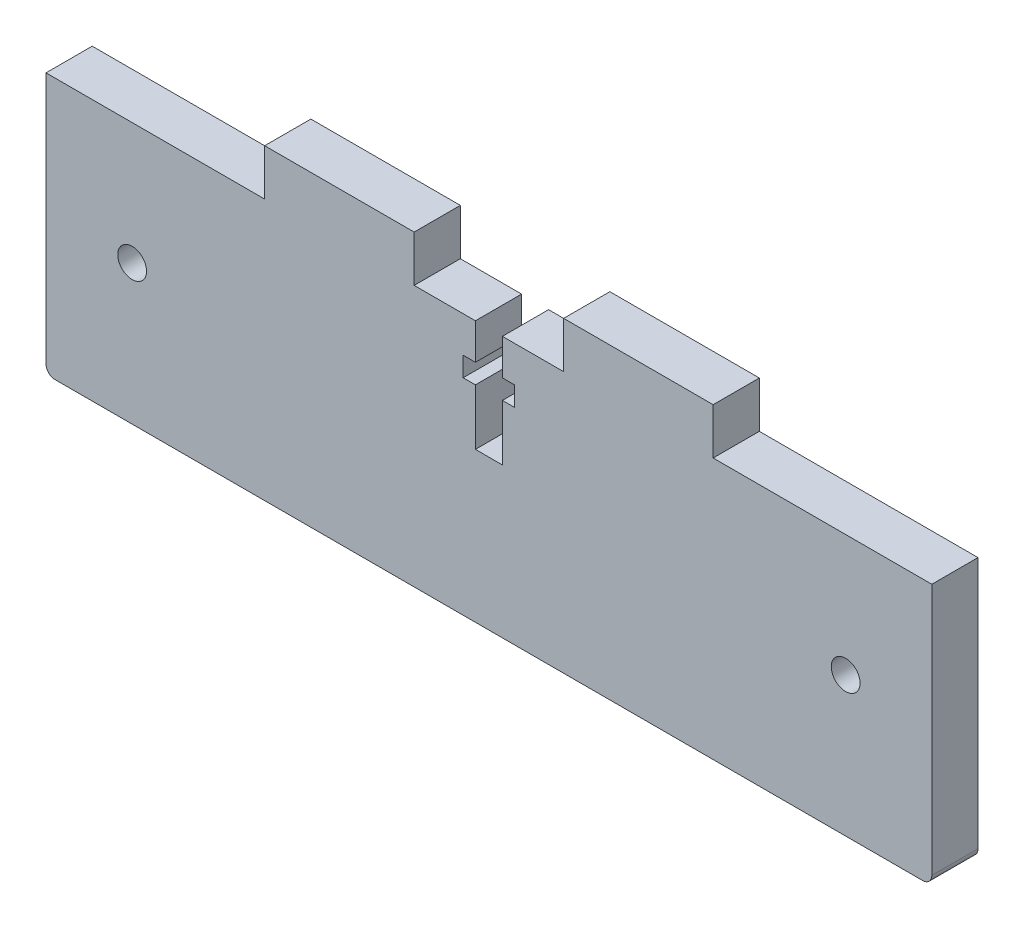
ISO-10303-21;
HEADER;
FILE_DESCRIPTION(('STEP AP214'),'2;1');
FILE_NAME('part.step','',(''),(''),'','','');
FILE_SCHEMA(('AUTOMOTIVE_DESIGN { 1 0 10303 214 1 1 1 1 }'));
ENDSEC;
DATA;
#1=APPLICATION_CONTEXT('core data for automotive mechanical design processes');
#2=APPLICATION_PROTOCOL_DEFINITION('international standard','automotive_design',2000,#1);
#3=PRODUCT_CONTEXT('',#1,'mechanical');
#4=PRODUCT('Part','Part','',(#3));
#5=PRODUCT_RELATED_PRODUCT_CATEGORY('part','',(#4));
#6=PRODUCT_DEFINITION_FORMATION('','',#4);
#7=PRODUCT_DEFINITION_CONTEXT('part definition',#1,'design');
#8=PRODUCT_DEFINITION('design','',#6,#7);
#9=PRODUCT_DEFINITION_SHAPE('','',#8);
#10=(LENGTH_UNIT() NAMED_UNIT(*) SI_UNIT(.MILLI.,.METRE.));
#11=(NAMED_UNIT(*) PLANE_ANGLE_UNIT() SI_UNIT($,.RADIAN.));
#12=(NAMED_UNIT(*) SI_UNIT($,.STERADIAN.) SOLID_ANGLE_UNIT());
#13=UNCERTAINTY_MEASURE_WITH_UNIT(LENGTH_MEASURE(1.E-05),#10,'distance_accuracy_value','');
#14=(GEOMETRIC_REPRESENTATION_CONTEXT(3) GLOBAL_UNCERTAINTY_ASSIGNED_CONTEXT((#13)) GLOBAL_UNIT_ASSIGNED_CONTEXT((#10,
#11,#12)) REPRESENTATION_CONTEXT('',''));
#15=CARTESIAN_POINT('',(0.,0.,0.));
#16=DIRECTION('',(0.,0.,1.));
#17=DIRECTION('',(1.,0.,0.));
#18=AXIS2_PLACEMENT_3D('',#15,#16,#17);
#19=CARTESIAN_POINT('',(-54.0961097270808,17.4962532479655,5.13));
#20=DIRECTION('',(0.,-1.,0.));
#21=DIRECTION('',(0.,0.,-1.));
#22=AXIS2_PLACEMENT_3D('',#19,#20,#21);
#23=PLANE('',#22);
#24=DIRECTION('',(0.,0.,-1.));
#25=VECTOR('',#24,1.);
#26=CARTESIAN_POINT('',(-3.41761062800432,17.4962532479656,135.42936115125));
#27=LINE('',#26,#25);
#28=CARTESIAN_POINT('',(-3.41761062800432,17.4962532479656,5.13));
#29=VERTEX_POINT('',#28);
#30=CARTESIAN_POINT('',(-3.41761062800432,17.4962532479656,0.));
#31=VERTEX_POINT('',#30);
#32=EDGE_CURVE('E224',#29,#31,#27,.T.);
#33=ORIENTED_EDGE('',*,*,#32,.F.);
#34=DIRECTION('',(-1.,0.,0.));
#35=VECTOR('',#34,1.);
#36=CARTESIAN_POINT('',(-54.0961097270808,17.4962532479655,5.13));
#37=LINE('',#36,#35);
#38=CARTESIAN_POINT('',(3.38389027291922,17.4962532479655,5.12999999999976));
#39=VERTEX_POINT('',#38);
#40=EDGE_CURVE('E230',#39,#29,#37,.T.);
#41=ORIENTED_EDGE('',*,*,#40,.F.);
#42=DIRECTION('',(0.,0.,1.));
#43=VECTOR('',#42,1.);
#44=CARTESIAN_POINT('',(3.38389027291921,17.4962532479655,0.));
#45=LINE('',#44,#43);
#46=CARTESIAN_POINT('',(3.38389027291922,17.4962532479655,0.));
#47=VERTEX_POINT('',#46);
#48=EDGE_CURVE('E388',#47,#39,#45,.T.);
#49=ORIENTED_EDGE('',*,*,#48,.F.);
#50=DIRECTION('',(-1.,0.,0.));
#51=VECTOR('',#50,1.);
#52=CARTESIAN_POINT('',(-54.0961097270808,17.4962532479655,0.));
#53=LINE('',#52,#51);
#54=EDGE_CURVE('E260',#47,#31,#53,.T.);
#55=ORIENTED_EDGE('',*,*,#54,.T.);
#56=EDGE_LOOP('',(#33,#41,#49,#55));
#57=FACE_BOUND('',#56,.T.);
#58=ADVANCED_FACE('F32',(#57),#23,.F.);
#59=DIRECTION('',(0.,0.,-1.));
#60=VECTOR('',#59,1.);
#61=CARTESIAN_POINT('',(-6.41460882615723,17.4962538375131,135.42936115125));
#62=LINE('',#61,#60);
#63=CARTESIAN_POINT('',(-6.41460882615723,17.4962538375131,5.13));
#64=VERTEX_POINT('',#63);
#65=CARTESIAN_POINT('',(-6.41460882615723,17.4962538375131,0.));
#66=VERTEX_POINT('',#65);
#67=EDGE_CURVE('E206',#64,#66,#62,.T.);
#68=ORIENTED_EDGE('',*,*,#67,.T.);
#69=CARTESIAN_POINT('',(-13.2161097270808,17.4962532479655,0.));
#70=VERTEX_POINT('',#69);
#71=EDGE_CURVE('E245',#66,#70,#53,.T.);
#72=ORIENTED_EDGE('',*,*,#71,.T.);
#73=DIRECTION('',(0.,0.,-1.));
#74=VECTOR('',#73,1.);
#75=CARTESIAN_POINT('',(-13.2161097270808,17.4962532479655,2.4809780467034E-13));
#76=LINE('',#75,#74);
#77=CARTESIAN_POINT('',(-13.2161097270808,17.4962532479655,5.13));
#78=VERTEX_POINT('',#77);
#79=EDGE_CURVE('E228',#78,#70,#76,.T.);
#80=ORIENTED_EDGE('',*,*,#79,.F.);
#81=EDGE_CURVE('E36',#64,#78,#37,.T.);
#82=ORIENTED_EDGE('',*,*,#81,.F.);
#83=EDGE_LOOP('',(#68,#72,#80,#82));
#84=FACE_BOUND('',#83,.T.);
#85=ADVANCED_FACE('F226',(#84),#23,.F.);
#86=CARTESIAN_POINT('',(-53.0961097270808,-10.5037467520345,5.13));
#87=DIRECTION('',(0.,0.,-1.));
#88=DIRECTION('',(-1.,0.,0.));
#89=AXIS2_PLACEMENT_3D('',#86,#87,#88);
#90=PLANE('',#89);
#91=CARTESIAN_POINT('',(-44.5301097270808,3.99625324796552,5.13));
#92=DIRECTION('',(0.,0.,1.));
#93=DIRECTION('',(1.,0.,0.));
#94=AXIS2_PLACEMENT_3D('',#91,#92,#93);
#95=CIRCLE('',#94,1.59999999999999);
#96=CARTESIAN_POINT('',(-42.9301097270808,3.99625324796552,5.13));
#97=VERTEX_POINT('',#96);
#98=EDGE_CURVE('E424',#97,#97,#95,.T.);
#99=ORIENTED_EDGE('',*,*,#98,.F.);
#100=EDGE_LOOP('',(#99));
#101=FACE_BOUND('',#100,.T.);
#102=CARTESIAN_POINT('',(34.6978902729192,3.99625324796552,5.13));
#103=DIRECTION('',(0.,0.,1.));
#104=DIRECTION('',(1.,0.,0.));
#105=AXIS2_PLACEMENT_3D('',#102,#103,#104);
#106=CIRCLE('',#105,1.59999999999999);
#107=CARTESIAN_POINT('',(36.2978902729192,3.99625324796552,5.13));
#108=VERTEX_POINT('',#107);
#109=EDGE_CURVE('E432',#108,#108,#106,.T.);
#110=ORIENTED_EDGE('',*,*,#109,.F.);
#111=EDGE_LOOP('',(#110));
#112=FACE_BOUND('',#111,.T.);
#113=DIRECTION('',(0.,1.,0.));
#114=VECTOR('',#113,1.);
#115=CARTESIAN_POINT('',(-3.41761062800432,-10.5037467520345,5.13));
#116=LINE('',#115,#114);
#117=CARTESIAN_POINT('',(-3.41761062800432,13.5012532479656,5.13));
#118=VERTEX_POINT('',#117);
#119=EDGE_CURVE('E359',#118,#29,#116,.T.);
#120=ORIENTED_EDGE('',*,*,#119,.F.);
#121=DIRECTION('',(-0.999999999999981,1.9671268505111E-07,0.));
#122=VECTOR('',#121,1.);
#123=CARTESIAN_POINT('',(-53.0961050049909,13.5012630203556,5.13));
#124=LINE('',#123,#122);
#125=CARTESIAN_POINT('',(-2.05861182325638,13.5012529806333,5.13));
#126=VERTEX_POINT('',#125);
#127=EDGE_CURVE('E357',#126,#118,#124,.T.);
#128=ORIENTED_EDGE('',*,*,#127,.F.);
#129=DIRECTION('',(1.96712683364631E-07,0.999999999999981,0.));
#130=VECTOR('',#129,1.);
#131=CARTESIAN_POINT('',(-2.05861654534626,-10.5037567917567,5.13));
#132=LINE('',#131,#130);
#133=CARTESIAN_POINT('',(-2.05861224953276,11.3342529806376,5.13));
#134=VERTEX_POINT('',#133);
#135=EDGE_CURVE('E334',#134,#126,#132,.T.);
#136=ORIENTED_EDGE('',*,*,#135,.F.);
#137=DIRECTION('',(0.999999999999981,-1.96712684364157E-07,0.));
#138=VECTOR('',#137,1.);
#139=CARTESIAN_POINT('',(-53.0961054312673,11.3342630203599,5.13));
#140=LINE('',#139,#138);
#141=CARTESIAN_POINT('',(-3.41761224953274,11.3342532479701,5.13));
#142=VERTEX_POINT('',#141);
#143=EDGE_CURVE('E354',#142,#134,#140,.T.);
#144=ORIENTED_EDGE('',*,*,#143,.F.);
#145=DIRECTION('',(1.96712681780521E-07,0.999999999999981,0.));
#146=VECTOR('',#145,1.);
#147=CARTESIAN_POINT('',(-3.41761654534621,-10.5037565244241,5.13));
#148=LINE('',#147,#146);
#149=CARTESIAN_POINT('',(-3.41761347052836,5.12725324797015,5.13));
#150=VERTEX_POINT('',#149);
#151=EDGE_CURVE('E352',#150,#142,#148,.T.);
#152=ORIENTED_EDGE('',*,*,#151,.F.);
#153=DIRECTION('',(0.999999999999981,-1.96712688344976E-07,0.));
#154=VECTOR('',#153,1.);
#155=CARTESIAN_POINT('',(-53.0961066522628,5.12726302036009,5.13));
#156=LINE('',#155,#154);
#157=CARTESIAN_POINT('',(-6.4146134705284,5.12725383751808,5.13));
#158=VERTEX_POINT('',#157);
#159=EDGE_CURVE('E350',#158,#150,#156,.T.);
#160=ORIENTED_EDGE('',*,*,#159,.F.);
#161=DIRECTION('',(-1.96712688138659E-07,-0.999999999999981,0.));
#162=VECTOR('',#161,1.);
#163=CARTESIAN_POINT('',(-6.41461654534634,-10.5037559348765,5.13));
#164=LINE('',#163,#162);
#165=CARTESIAN_POINT('',(-6.41461224953275,11.334253837518,5.13));
#166=VERTEX_POINT('',#165);
#167=EDGE_CURVE('E348',#166,#158,#164,.T.);
#168=ORIENTED_EDGE('',*,*,#167,.F.);
#169=DIRECTION('',(0.999999999999981,-1.96712684364149E-07,0.));
#170=VECTOR('',#169,1.);
#171=CARTESIAN_POINT('',(-53.0961054312673,11.3342630203598,5.13));
#172=LINE('',#171,#170);
#173=CARTESIAN_POINT('',(-7.77361224953278,11.3342541048506,5.13));
#174=VERTEX_POINT('',#173);
#175=EDGE_CURVE('E346',#174,#166,#172,.T.);
#176=ORIENTED_EDGE('',*,*,#175,.F.);
#177=DIRECTION('',(-1.96712687767482E-07,-0.999999999999981,0.));
#178=VECTOR('',#177,1.);
#179=CARTESIAN_POINT('',(-7.77361654534638,-10.5037556675439,5.13));
#180=LINE('',#179,#178);
#181=CARTESIAN_POINT('',(-7.77361182325638,13.5012541048463,5.13));
#182=VERTEX_POINT('',#181);
#183=EDGE_CURVE('E344',#182,#174,#180,.T.);
#184=ORIENTED_EDGE('',*,*,#183,.F.);
#185=DIRECTION('',(-0.999999999999981,1.96712684539695E-07,0.));
#186=VECTOR('',#185,1.);
#187=CARTESIAN_POINT('',(-53.0961050049909,13.5012630203556,5.13));
#188=LINE('',#187,#186);
#189=CARTESIAN_POINT('',(-6.41460882615723,13.5012538375131,5.13));
#190=VERTEX_POINT('',#189);
#191=EDGE_CURVE('E223',#190,#182,#188,.T.);
#192=ORIENTED_EDGE('',*,*,#191,.F.);
#193=DIRECTION('',(0.,-1.,0.));
#194=VECTOR('',#193,1.);
#195=CARTESIAN_POINT('',(-6.41460882615723,-10.5037467520345,5.13));
#196=LINE('',#195,#194);
#197=EDGE_CURVE('E209',#64,#190,#196,.T.);
#198=ORIENTED_EDGE('',*,*,#197,.F.);
#199=ORIENTED_EDGE('',*,*,#81,.T.);
#200=DIRECTION('',(0.,-1.,0.));
#201=VECTOR('',#200,1.);
#202=CARTESIAN_POINT('',(-13.2161097270808,22.6262532479655,5.13000000000025));
#203=LINE('',#202,#201);
#204=CARTESIAN_POINT('',(-13.2161097270808,22.6262532479655,5.13000000000025));
#205=VERTEX_POINT('',#204);
#206=EDGE_CURVE('E371',#205,#78,#203,.T.);
#207=ORIENTED_EDGE('',*,*,#206,.F.);
#208=DIRECTION('',(1.,0.,0.));
#209=VECTOR('',#208,1.);
#210=CARTESIAN_POINT('',(-13.2161097270808,22.6262532479655,5.13000000000025));
#211=LINE('',#210,#209);
#212=CARTESIAN_POINT('',(-29.8161097270808,22.6262532479655,5.13000000000001));
#213=VERTEX_POINT('',#212);
#214=EDGE_CURVE('E369',#213,#205,#211,.T.);
#215=ORIENTED_EDGE('',*,*,#214,.F.);
#216=DIRECTION('',(0.,-1.,0.));
#217=VECTOR('',#216,1.);
#218=CARTESIAN_POINT('',(-29.8161097270808,22.6262532479655,5.13000000000001));
#219=LINE('',#218,#217);
#220=CARTESIAN_POINT('',(-29.8161097270808,17.4962532479655,5.13));
#221=VERTEX_POINT('',#220);
#222=EDGE_CURVE('E375',#213,#221,#219,.T.);
#223=ORIENTED_EDGE('',*,*,#222,.T.);
#224=CARTESIAN_POINT('',(-54.0961097270808,17.4962532479655,5.13));
#225=VERTEX_POINT('',#224);
#226=EDGE_CURVE('E57',#221,#225,#37,.T.);
#227=ORIENTED_EDGE('',*,*,#226,.T.);
#228=DIRECTION('',(0.,-1.,0.));
#229=VECTOR('',#228,1.);
#230=CARTESIAN_POINT('',(-54.0961097270808,17.4962532479655,5.13));
#231=LINE('',#230,#229);
#232=CARTESIAN_POINT('',(-54.0961097270808,-10.5037467520345,5.13));
#233=VERTEX_POINT('',#232);
#234=EDGE_CURVE('E440',#225,#233,#231,.T.);
#235=ORIENTED_EDGE('',*,*,#234,.T.);
#236=CARTESIAN_POINT('',(-53.0961097270808,-10.5037467520345,5.13));
#237=DIRECTION('',(0.,0.,1.));
#238=DIRECTION('',(-1.,0.,0.));
#239=AXIS2_PLACEMENT_3D('',#236,#237,#238);
#240=CIRCLE('',#239,1.);
#241=CARTESIAN_POINT('',(-53.0961097270808,-11.5037467520345,5.13));
#242=VERTEX_POINT('',#241);
#243=EDGE_CURVE('E442',#233,#242,#240,.T.);
#244=ORIENTED_EDGE('',*,*,#243,.T.);
#245=DIRECTION('',(1.,0.,0.));
#246=VECTOR('',#245,1.);
#247=CARTESIAN_POINT('',(-53.0961097270808,-11.5037467520345,5.13));
#248=LINE('',#247,#246);
#249=CARTESIAN_POINT('',(43.2638902729192,-11.5037467520345,5.13));
#250=VERTEX_POINT('',#249);
#251=EDGE_CURVE('E444',#242,#250,#248,.T.);
#252=ORIENTED_EDGE('',*,*,#251,.T.);
#253=CARTESIAN_POINT('',(43.2638902729192,-10.5037467520345,5.13));
#254=DIRECTION('',(0.,0.,1.));
#255=DIRECTION('',(1.,0.,0.));
#256=AXIS2_PLACEMENT_3D('',#253,#254,#255);
#257=CIRCLE('',#256,1.);
#258=CARTESIAN_POINT('',(44.2638902729192,-10.5037467520345,5.13));
#259=VERTEX_POINT('',#258);
#260=EDGE_CURVE('E238',#250,#259,#257,.T.);
#261=ORIENTED_EDGE('',*,*,#260,.T.);
#262=DIRECTION('',(0.,1.,0.));
#263=VECTOR('',#262,1.);
#264=CARTESIAN_POINT('',(44.2638902729192,17.4962532479655,5.13));
#265=LINE('',#264,#263);
#266=CARTESIAN_POINT('',(44.2638902729192,17.4962532479655,5.13));
#267=VERTEX_POINT('',#266);
#268=EDGE_CURVE('E234',#259,#267,#265,.T.);
#269=ORIENTED_EDGE('',*,*,#268,.T.);
#270=CARTESIAN_POINT('',(19.9838902729192,17.4962532479655,5.13));
#271=VERTEX_POINT('',#270);
#272=EDGE_CURVE('E232',#267,#271,#37,.T.);
#273=ORIENTED_EDGE('',*,*,#272,.T.);
#274=DIRECTION('',(0.,-1.,0.));
#275=VECTOR('',#274,1.);
#276=CARTESIAN_POINT('',(19.9838902729192,22.6262532479655,5.13));
#277=LINE('',#276,#275);
#278=CARTESIAN_POINT('',(19.9838902729192,22.6262532479655,5.13));
#279=VERTEX_POINT('',#278);
#280=EDGE_CURVE('E394',#279,#271,#277,.T.);
#281=ORIENTED_EDGE('',*,*,#280,.F.);
#282=DIRECTION('',(1.,0.,0.));
#283=VECTOR('',#282,1.);
#284=CARTESIAN_POINT('',(19.9838902729192,22.6262532479655,5.13));
#285=LINE('',#284,#283);
#286=CARTESIAN_POINT('',(3.38389027291922,22.6262532479655,5.12999999999976));
#287=VERTEX_POINT('',#286);
#288=EDGE_CURVE('E392',#287,#279,#285,.T.);
#289=ORIENTED_EDGE('',*,*,#288,.F.);
#290=DIRECTION('',(0.,-1.,0.));
#291=VECTOR('',#290,1.);
#292=CARTESIAN_POINT('',(3.38389027291922,22.6262532479655,5.12999999999976));
#293=LINE('',#292,#291);
#294=EDGE_CURVE('E406',#287,#39,#293,.T.);
#295=ORIENTED_EDGE('',*,*,#294,.T.);
#296=ORIENTED_EDGE('',*,*,#40,.T.);
#297=EDGE_LOOP('',(#120,#128,#136,#144,#152,#160,#168,#176,#184,#192,#198,#199,#207,#215,#223,
#227,#235,#244,#252,#261,#269,#273,#281,#289,#295,#296));
#298=FACE_BOUND('',#297,.T.);
#299=ADVANCED_FACE('F219',(#101,#112,#298),#90,.F.);
#300=CARTESIAN_POINT('',(-53.0961097270808,-10.5037467520345,0.));
#301=DIRECTION('',(0.,0.,-1.));
#302=DIRECTION('',(-1.,0.,0.));
#303=AXIS2_PLACEMENT_3D('',#300,#301,#302);
#304=PLANE('',#303);
#305=CARTESIAN_POINT('',(34.6978902729192,3.99625324796552,0.));
#306=DIRECTION('',(0.,0.,-1.));
#307=DIRECTION('',(-1.,0.,0.));
#308=AXIS2_PLACEMENT_3D('',#305,#306,#307);
#309=CIRCLE('',#308,1.59999999999999);
#310=CARTESIAN_POINT('',(33.0978902729192,3.99625324796552,0.));
#311=VERTEX_POINT('',#310);
#312=EDGE_CURVE('E437',#311,#311,#309,.T.);
#313=ORIENTED_EDGE('',*,*,#312,.F.);
#314=EDGE_LOOP('',(#313));
#315=FACE_BOUND('',#314,.T.);
#316=CARTESIAN_POINT('',(-44.5301097270808,3.99625324796552,0.));
#317=DIRECTION('',(0.,0.,-1.));
#318=DIRECTION('',(-1.,0.,0.));
#319=AXIS2_PLACEMENT_3D('',#316,#317,#318);
#320=CIRCLE('',#319,1.59999999999999);
#321=CARTESIAN_POINT('',(-46.1301097270808,3.99625324796552,0.));
#322=VERTEX_POINT('',#321);
#323=EDGE_CURVE('E428',#322,#322,#320,.T.);
#324=ORIENTED_EDGE('',*,*,#323,.F.);
#325=EDGE_LOOP('',(#324));
#326=FACE_BOUND('',#325,.T.);
#327=DIRECTION('',(-0.999999999999981,1.9671268505111E-07,0.));
#328=VECTOR('',#327,1.);
#329=CARTESIAN_POINT('',(-53.0961050049909,13.5012630203556,0.));
#330=LINE('',#329,#328);
#331=CARTESIAN_POINT('',(-2.05861182325638,13.5012529806333,0.));
#332=VERTEX_POINT('',#331);
#333=CARTESIAN_POINT('',(-3.41761062800432,13.5012532479656,0.));
#334=VERTEX_POINT('',#333);
#335=EDGE_CURVE('E42',#332,#334,#330,.T.);
#336=ORIENTED_EDGE('',*,*,#335,.T.);
#337=DIRECTION('',(0.,1.,0.));
#338=VECTOR('',#337,1.);
#339=CARTESIAN_POINT('',(-3.41761062800432,-10.5037467520345,0.));
#340=LINE('',#339,#338);
#341=EDGE_CURVE('E11',#334,#31,#340,.T.);
#342=ORIENTED_EDGE('',*,*,#341,.T.);
#343=ORIENTED_EDGE('',*,*,#54,.F.);
#344=DIRECTION('',(0.,-1.,0.));
#345=VECTOR('',#344,1.);
#346=CARTESIAN_POINT('',(3.38389027291921,22.6262532479655,0.));
#347=LINE('',#346,#345);
#348=CARTESIAN_POINT('',(3.38389027291921,22.6262532479655,0.));
#349=VERTEX_POINT('',#348);
#350=EDGE_CURVE('E412',#349,#47,#347,.T.);
#351=ORIENTED_EDGE('',*,*,#350,.F.);
#352=DIRECTION('',(-1.,0.,0.));
#353=VECTOR('',#352,1.);
#354=CARTESIAN_POINT('',(19.9838902729192,22.6262532479655,0.));
#355=LINE('',#354,#353);
#356=CARTESIAN_POINT('',(19.9838902729192,22.6262532479655,0.));
#357=VERTEX_POINT('',#356);
#358=EDGE_CURVE('E387',#357,#349,#355,.T.);
#359=ORIENTED_EDGE('',*,*,#358,.F.);
#360=DIRECTION('',(0.,-1.,0.));
#361=VECTOR('',#360,1.);
#362=CARTESIAN_POINT('',(19.9838902729192,22.6262532479655,0.));
#363=LINE('',#362,#361);
#364=CARTESIAN_POINT('',(19.9838902729192,17.4962532479655,0.));
#365=VERTEX_POINT('',#364);
#366=EDGE_CURVE('E417',#357,#365,#363,.T.);
#367=ORIENTED_EDGE('',*,*,#366,.T.);
#368=CARTESIAN_POINT('',(44.2638902729192,17.4962532479655,0.));
#369=VERTEX_POINT('',#368);
#370=EDGE_CURVE('E263',#369,#365,#53,.T.);
#371=ORIENTED_EDGE('',*,*,#370,.F.);
#372=DIRECTION('',(0.,1.,0.));
#373=VECTOR('',#372,1.);
#374=CARTESIAN_POINT('',(44.2638902729192,17.4962532479655,0.));
#375=LINE('',#374,#373);
#376=CARTESIAN_POINT('',(44.2638902729192,-10.5037467520345,0.));
#377=VERTEX_POINT('',#376);
#378=EDGE_CURVE('E268',#377,#369,#375,.T.);
#379=ORIENTED_EDGE('',*,*,#378,.F.);
#380=CARTESIAN_POINT('',(43.2638902729192,-10.5037467520345,0.));
#381=DIRECTION('',(0.,0.,1.));
#382=DIRECTION('',(1.,0.,0.));
#383=AXIS2_PLACEMENT_3D('',#380,#381,#382);
#384=CIRCLE('',#383,1.);
#385=CARTESIAN_POINT('',(43.2638902729192,-11.5037467520345,0.));
#386=VERTEX_POINT('',#385);
#387=EDGE_CURVE('E454',#386,#377,#384,.T.);
#388=ORIENTED_EDGE('',*,*,#387,.F.);
#389=DIRECTION('',(1.,0.,0.));
#390=VECTOR('',#389,1.);
#391=CARTESIAN_POINT('',(-53.0961097270808,-11.5037467520345,0.));
#392=LINE('',#391,#390);
#393=CARTESIAN_POINT('',(-53.0961097270808,-11.5037467520345,0.));
#394=VERTEX_POINT('',#393);
#395=EDGE_CURVE('E508',#394,#386,#392,.T.);
#396=ORIENTED_EDGE('',*,*,#395,.F.);
#397=CARTESIAN_POINT('',(-53.0961097270808,-10.5037467520345,0.));
#398=DIRECTION('',(0.,0.,1.));
#399=DIRECTION('',(-1.,0.,0.));
#400=AXIS2_PLACEMENT_3D('',#397,#398,#399);
#401=CIRCLE('',#400,1.);
#402=CARTESIAN_POINT('',(-54.0961097270808,-10.5037467520345,0.));
#403=VERTEX_POINT('',#402);
#404=EDGE_CURVE('E509',#403,#394,#401,.T.);
#405=ORIENTED_EDGE('',*,*,#404,.F.);
#406=DIRECTION('',(0.,-1.,0.));
#407=VECTOR('',#406,1.);
#408=CARTESIAN_POINT('',(-54.0961097270808,17.4962532479655,0.));
#409=LINE('',#408,#407);
#410=CARTESIAN_POINT('',(-54.0961097270808,17.4962532479655,0.));
#411=VERTEX_POINT('',#410);
#412=EDGE_CURVE('E250',#411,#403,#409,.T.);
#413=ORIENTED_EDGE('',*,*,#412,.F.);
#414=CARTESIAN_POINT('',(-29.8161097270808,17.4962532479655,2.50375647716754E-13));
#415=VERTEX_POINT('',#414);
#416=EDGE_CURVE('E242',#415,#411,#53,.T.);
#417=ORIENTED_EDGE('',*,*,#416,.F.);
#418=DIRECTION('',(0.,-1.,0.));
#419=VECTOR('',#418,1.);
#420=CARTESIAN_POINT('',(-29.8161097270808,22.6262532479655,2.50375647716754E-13));
#421=LINE('',#420,#419);
#422=CARTESIAN_POINT('',(-29.8161097270808,22.6262532479655,2.50375647716754E-13));
#423=VERTEX_POINT('',#422);
#424=EDGE_CURVE('E377',#423,#415,#421,.T.);
#425=ORIENTED_EDGE('',*,*,#424,.F.);
#426=DIRECTION('',(-1.,0.,0.));
#427=VECTOR('',#426,1.);
#428=CARTESIAN_POINT('',(-13.2161097270808,22.6262532479655,2.4809780467034E-13));
#429=LINE('',#428,#427);
#430=CARTESIAN_POINT('',(-13.2161097270808,22.6262532479655,2.4809780467034E-13));
#431=VERTEX_POINT('',#430);
#432=EDGE_CURVE('E364',#431,#423,#429,.T.);
#433=ORIENTED_EDGE('',*,*,#432,.F.);
#434=DIRECTION('',(0.,-1.,0.));
#435=VECTOR('',#434,1.);
#436=CARTESIAN_POINT('',(-13.2161097270808,22.6262532479655,2.4809780467034E-13));
#437=LINE('',#436,#435);
#438=EDGE_CURVE('E380',#431,#70,#437,.T.);
#439=ORIENTED_EDGE('',*,*,#438,.T.);
#440=ORIENTED_EDGE('',*,*,#71,.F.);
#441=DIRECTION('',(0.,-1.,0.));
#442=VECTOR('',#441,1.);
#443=CARTESIAN_POINT('',(-6.41460882615723,-10.5037467520345,0.));
#444=LINE('',#443,#442);
#445=CARTESIAN_POINT('',(-6.41460882615723,13.5012538375131,0.));
#446=VERTEX_POINT('',#445);
#447=EDGE_CURVE('E211',#66,#446,#444,.T.);
#448=ORIENTED_EDGE('',*,*,#447,.T.);
#449=DIRECTION('',(-0.999999999999981,1.96712684539695E-07,0.));
#450=VECTOR('',#449,1.);
#451=CARTESIAN_POINT('',(-53.0961050049909,13.5012630203556,0.));
#452=LINE('',#451,#450);
#453=CARTESIAN_POINT('',(-7.77361182325638,13.5012541048463,0.));
#454=VERTEX_POINT('',#453);
#455=EDGE_CURVE('E291',#446,#454,#452,.T.);
#456=ORIENTED_EDGE('',*,*,#455,.T.);
#457=DIRECTION('',(-1.96712687767482E-07,-0.999999999999981,0.));
#458=VECTOR('',#457,1.);
#459=CARTESIAN_POINT('',(-7.77361654534638,-10.5037556675439,0.));
#460=LINE('',#459,#458);
#461=CARTESIAN_POINT('',(-7.77361224953278,11.3342541048506,0.));
#462=VERTEX_POINT('',#461);
#463=EDGE_CURVE('E294',#454,#462,#460,.T.);
#464=ORIENTED_EDGE('',*,*,#463,.T.);
#465=DIRECTION('',(0.999999999999981,-1.96712684364149E-07,0.));
#466=VECTOR('',#465,1.);
#467=CARTESIAN_POINT('',(-53.0961054312673,11.3342630203598,0.));
#468=LINE('',#467,#466);
#469=CARTESIAN_POINT('',(-6.41461224953275,11.334253837518,0.));
#470=VERTEX_POINT('',#469);
#471=EDGE_CURVE('E299',#462,#470,#468,.T.);
#472=ORIENTED_EDGE('',*,*,#471,.T.);
#473=DIRECTION('',(-1.96712688138659E-07,-0.999999999999981,0.));
#474=VECTOR('',#473,1.);
#475=CARTESIAN_POINT('',(-6.41461654534634,-10.5037559348765,0.));
#476=LINE('',#475,#474);
#477=CARTESIAN_POINT('',(-6.4146134705284,5.12725383751808,0.));
#478=VERTEX_POINT('',#477);
#479=EDGE_CURVE('E302',#470,#478,#476,.T.);
#480=ORIENTED_EDGE('',*,*,#479,.T.);
#481=DIRECTION('',(0.999999999999981,-1.96712688344976E-07,0.));
#482=VECTOR('',#481,1.);
#483=CARTESIAN_POINT('',(-53.0961066522628,5.12726302036009,0.));
#484=LINE('',#483,#482);
#485=CARTESIAN_POINT('',(-3.41761347052836,5.12725324797015,0.));
#486=VERTEX_POINT('',#485);
#487=EDGE_CURVE('E305',#478,#486,#484,.T.);
#488=ORIENTED_EDGE('',*,*,#487,.T.);
#489=DIRECTION('',(1.96712681780521E-07,0.999999999999981,0.));
#490=VECTOR('',#489,1.);
#491=CARTESIAN_POINT('',(-3.41761654534621,-10.5037565244241,0.));
#492=LINE('',#491,#490);
#493=CARTESIAN_POINT('',(-3.41761224953274,11.3342532479701,0.));
#494=VERTEX_POINT('',#493);
#495=EDGE_CURVE('E308',#486,#494,#492,.T.);
#496=ORIENTED_EDGE('',*,*,#495,.T.);
#497=DIRECTION('',(0.999999999999981,-1.96712684364157E-07,0.));
#498=VECTOR('',#497,1.);
#499=CARTESIAN_POINT('',(-53.0961054312673,11.3342630203599,0.));
#500=LINE('',#499,#498);
#501=CARTESIAN_POINT('',(-2.05861224953276,11.3342529806376,0.));
#502=VERTEX_POINT('',#501);
#503=EDGE_CURVE('E311',#494,#502,#500,.T.);
#504=ORIENTED_EDGE('',*,*,#503,.T.);
#505=DIRECTION('',(1.96712683364631E-07,0.999999999999981,0.));
#506=VECTOR('',#505,1.);
#507=CARTESIAN_POINT('',(-2.05861654534626,-10.5037567917567,0.));
#508=LINE('',#507,#506);
#509=EDGE_CURVE('E314',#502,#332,#508,.T.);
#510=ORIENTED_EDGE('',*,*,#509,.T.);
#511=EDGE_LOOP('',(#336,#342,#343,#351,#359,#367,#371,#379,#388,#396,#405,#413,#417,#425,#433,
#439,#440,#448,#456,#464,#472,#480,#488,#496,#504,#510));
#512=FACE_BOUND('',#511,.T.);
#513=ADVANCED_FACE('F318',(#315,#326,#512),#304,.T.);
#514=DIRECTION('',(0.,0.,1.));
#515=VECTOR('',#514,1.);
#516=CARTESIAN_POINT('',(-29.8161097270808,17.4962532479655,2.50375647716754E-13));
#517=LINE('',#516,#515);
#518=EDGE_CURVE('E365',#415,#221,#517,.T.);
#519=ORIENTED_EDGE('',*,*,#518,.F.);
#520=ORIENTED_EDGE('',*,*,#416,.T.);
#521=DIRECTION('',(0.,0.,-1.));
#522=VECTOR('',#521,1.);
#523=CARTESIAN_POINT('',(-54.0961097270808,17.4962532479655,5.13));
#524=LINE('',#523,#522);
#525=EDGE_CURVE('E259',#225,#411,#524,.T.);
#526=ORIENTED_EDGE('',*,*,#525,.F.);
#527=ORIENTED_EDGE('',*,*,#226,.F.);
#528=EDGE_LOOP('',(#519,#520,#526,#527));
#529=FACE_BOUND('',#528,.T.);
#530=ADVANCED_FACE('F489',(#529),#23,.F.);
#531=DIRECTION('',(0.,0.,-1.));
#532=VECTOR('',#531,1.);
#533=CARTESIAN_POINT('',(19.9838902729192,17.4962532479655,0.));
#534=LINE('',#533,#532);
#535=EDGE_CURVE('E383',#271,#365,#534,.T.);
#536=ORIENTED_EDGE('',*,*,#535,.F.);
#537=ORIENTED_EDGE('',*,*,#272,.F.);
#538=DIRECTION('',(0.,0.,-1.));
#539=VECTOR('',#538,1.);
#540=CARTESIAN_POINT('',(44.2638902729192,17.4962532479655,5.13));
#541=LINE('',#540,#539);
#542=EDGE_CURVE('E275',#267,#369,#541,.T.);
#543=ORIENTED_EDGE('',*,*,#542,.T.);
#544=ORIENTED_EDGE('',*,*,#370,.T.);
#545=EDGE_LOOP('',(#536,#537,#543,#544));
#546=FACE_BOUND('',#545,.T.);
#547=ADVANCED_FACE('F460',(#546),#23,.F.);
#548=CARTESIAN_POINT('',(-54.0961097270808,17.4962532479655,5.13));
#549=DIRECTION('',(1.,0.,0.));
#550=DIRECTION('',(0.,0.,-1.));
#551=AXIS2_PLACEMENT_3D('',#548,#549,#550);
#552=PLANE('',#551);
#553=ORIENTED_EDGE('',*,*,#412,.T.);
#554=DIRECTION('',(0.,0.,-1.));
#555=VECTOR('',#554,1.);
#556=CARTESIAN_POINT('',(-54.0961097270808,-10.5037467520345,5.13));
#557=LINE('',#556,#555);
#558=EDGE_CURVE('E286',#233,#403,#557,.T.);
#559=ORIENTED_EDGE('',*,*,#558,.F.);
#560=ORIENTED_EDGE('',*,*,#234,.F.);
#561=ORIENTED_EDGE('',*,*,#525,.T.);
#562=EDGE_LOOP('',(#553,#559,#560,#561));
#563=FACE_BOUND('',#562,.T.);
#564=ADVANCED_FACE('F34',(#563),#552,.F.);
#565=CARTESIAN_POINT('',(-53.0961097270808,-10.5037467520345,5.13));
#566=DIRECTION('',(0.,0.,-1.));
#567=DIRECTION('',(-1.,0.,0.));
#568=AXIS2_PLACEMENT_3D('',#565,#566,#567);
#569=CYLINDRICAL_SURFACE('',#568,1.);
#570=ORIENTED_EDGE('',*,*,#404,.T.);
#571=DIRECTION('',(0.,0.,-1.));
#572=VECTOR('',#571,1.);
#573=CARTESIAN_POINT('',(-53.0961097270808,-11.5037467520345,5.13));
#574=LINE('',#573,#572);
#575=EDGE_CURVE('E284',#242,#394,#574,.T.);
#576=ORIENTED_EDGE('',*,*,#575,.F.);
#577=ORIENTED_EDGE('',*,*,#243,.F.);
#578=ORIENTED_EDGE('',*,*,#558,.T.);
#579=EDGE_LOOP('',(#570,#576,#577,#578));
#580=FACE_BOUND('',#579,.T.);
#581=ADVANCED_FACE('F497',(#580),#569,.T.);
#582=CARTESIAN_POINT('',(-53.0961097270808,-11.5037467520345,5.13));
#583=DIRECTION('',(0.,1.,0.));
#584=DIRECTION('',(0.,0.,1.));
#585=AXIS2_PLACEMENT_3D('',#582,#583,#584);
#586=PLANE('',#585);
#587=ORIENTED_EDGE('',*,*,#395,.T.);
#588=DIRECTION('',(0.,0.,-1.));
#589=VECTOR('',#588,1.);
#590=CARTESIAN_POINT('',(43.2638902729192,-11.5037467520345,5.13));
#591=LINE('',#590,#589);
#592=EDGE_CURVE('E281',#250,#386,#591,.T.);
#593=ORIENTED_EDGE('',*,*,#592,.F.);
#594=ORIENTED_EDGE('',*,*,#251,.F.);
#595=ORIENTED_EDGE('',*,*,#575,.T.);
#596=EDGE_LOOP('',(#587,#593,#594,#595));
#597=FACE_BOUND('',#596,.T.);
#598=ADVANCED_FACE('F515',(#597),#586,.F.);
#599=CARTESIAN_POINT('',(43.2638902729192,-10.5037467520345,5.13));
#600=DIRECTION('',(0.,0.,-1.));
#601=DIRECTION('',(-1.,0.,0.));
#602=AXIS2_PLACEMENT_3D('',#599,#600,#601);
#603=CYLINDRICAL_SURFACE('',#602,1.);
#604=ORIENTED_EDGE('',*,*,#387,.T.);
#605=DIRECTION('',(0.,0.,-1.));
#606=VECTOR('',#605,1.);
#607=CARTESIAN_POINT('',(44.2638902729192,-10.5037467520345,5.13));
#608=LINE('',#607,#606);
#609=EDGE_CURVE('E278',#259,#377,#608,.T.);
#610=ORIENTED_EDGE('',*,*,#609,.F.);
#611=ORIENTED_EDGE('',*,*,#260,.F.);
#612=ORIENTED_EDGE('',*,*,#592,.T.);
#613=EDGE_LOOP('',(#604,#610,#611,#612));
#614=FACE_BOUND('',#613,.T.);
#615=ADVANCED_FACE('F452',(#614),#603,.T.);
#616=CARTESIAN_POINT('',(44.2638902729192,17.4962532479655,5.13));
#617=DIRECTION('',(-1.,0.,0.));
#618=DIRECTION('',(0.,-1.,0.));
#619=AXIS2_PLACEMENT_3D('',#616,#617,#618);
#620=PLANE('',#619);
#621=ORIENTED_EDGE('',*,*,#378,.T.);
#622=ORIENTED_EDGE('',*,*,#542,.F.);
#623=ORIENTED_EDGE('',*,*,#268,.F.);
#624=ORIENTED_EDGE('',*,*,#609,.T.);
#625=EDGE_LOOP('',(#621,#622,#623,#624));
#626=FACE_BOUND('',#625,.T.);
#627=ADVANCED_FACE('F457',(#626),#620,.F.);
#628=CARTESIAN_POINT('',(34.6978902729192,3.99625324796552,5.13));
#629=DIRECTION('',(0.,0.,1.));
#630=DIRECTION('',(1.,0.,0.));
#631=AXIS2_PLACEMENT_3D('',#628,#629,#630);
#632=CYLINDRICAL_SURFACE('',#631,1.59999999999999);
#633=ORIENTED_EDGE('',*,*,#109,.T.);
#634=EDGE_LOOP('',(#633));
#635=FACE_BOUND('',#634,.T.);
#636=ORIENTED_EDGE('',*,*,#312,.T.);
#637=EDGE_LOOP('',(#636));
#638=FACE_BOUND('',#637,.T.);
#639=ADVANCED_FACE('F524',(#635,#638),#632,.F.);
#640=CARTESIAN_POINT('',(-44.5301097270808,3.99625324796552,5.13));
#641=DIRECTION('',(0.,0.,1.));
#642=DIRECTION('',(1.,0.,0.));
#643=AXIS2_PLACEMENT_3D('',#640,#641,#642);
#644=CYLINDRICAL_SURFACE('',#643,1.59999999999999);
#645=ORIENTED_EDGE('',*,*,#98,.T.);
#646=EDGE_LOOP('',(#645));
#647=FACE_BOUND('',#646,.T.);
#648=ORIENTED_EDGE('',*,*,#323,.T.);
#649=EDGE_LOOP('',(#648));
#650=FACE_BOUND('',#649,.T.);
#651=ADVANCED_FACE('F528',(#647,#650),#644,.F.);
#652=CARTESIAN_POINT('',(19.9838902729192,22.6262532479655,0.));
#653=DIRECTION('',(-1.,0.,0.));
#654=DIRECTION('',(0.,0.,1.));
#655=AXIS2_PLACEMENT_3D('',#652,#653,#654);
#656=PLANE('',#655);
#657=ORIENTED_EDGE('',*,*,#535,.T.);
#658=ORIENTED_EDGE('',*,*,#366,.F.);
#659=DIRECTION('',(0.,0.,-1.));
#660=VECTOR('',#659,1.);
#661=CARTESIAN_POINT('',(19.9838902729192,22.6262532479655,0.));
#662=LINE('',#661,#660);
#663=EDGE_CURVE('E384',#279,#357,#662,.T.);
#664=ORIENTED_EDGE('',*,*,#663,.F.);
#665=ORIENTED_EDGE('',*,*,#280,.T.);
#666=EDGE_LOOP('',(#657,#658,#664,#665));
#667=FACE_BOUND('',#666,.T.);
#668=ADVANCED_FACE('F461',(#667),#656,.F.);
#669=CARTESIAN_POINT('',(3.38389027291921,22.6262532479655,0.));
#670=DIRECTION('',(1.,0.,0.));
#671=DIRECTION('',(0.,0.,-1.));
#672=AXIS2_PLACEMENT_3D('',#669,#670,#671);
#673=PLANE('',#672);
#674=ORIENTED_EDGE('',*,*,#48,.T.);
#675=ORIENTED_EDGE('',*,*,#294,.F.);
#676=DIRECTION('',(0.,0.,1.));
#677=VECTOR('',#676,1.);
#678=CARTESIAN_POINT('',(3.38389027291921,22.6262532479655,0.));
#679=LINE('',#678,#677);
#680=EDGE_CURVE('E390',#349,#287,#679,.T.);
#681=ORIENTED_EDGE('',*,*,#680,.F.);
#682=ORIENTED_EDGE('',*,*,#350,.T.);
#683=EDGE_LOOP('',(#674,#675,#681,#682));
#684=FACE_BOUND('',#683,.T.);
#685=ADVANCED_FACE('F468',(#684),#673,.F.);
#686=CARTESIAN_POINT('',(19.9838902729192,22.6262532479655,5.13));
#687=DIRECTION('',(0.,-1.,0.));
#688=DIRECTION('',(0.,0.,-1.));
#689=AXIS2_PLACEMENT_3D('',#686,#687,#688);
#690=PLANE('',#689);
#691=ORIENTED_EDGE('',*,*,#663,.T.);
#692=ORIENTED_EDGE('',*,*,#358,.T.);
#693=ORIENTED_EDGE('',*,*,#680,.T.);
#694=ORIENTED_EDGE('',*,*,#288,.T.);
#695=EDGE_LOOP('',(#691,#692,#693,#694));
#696=FACE_BOUND('',#695,.T.);
#697=ADVANCED_FACE('F463',(#696),#690,.F.);
#698=CARTESIAN_POINT('',(-13.2161097270808,22.6262532479655,2.4809780467034E-13));
#699=DIRECTION('',(-1.,0.,0.));
#700=DIRECTION('',(0.,0.,1.));
#701=AXIS2_PLACEMENT_3D('',#698,#699,#700);
#702=PLANE('',#701);
#703=ORIENTED_EDGE('',*,*,#79,.T.);
#704=ORIENTED_EDGE('',*,*,#438,.F.);
#705=DIRECTION('',(0.,0.,-1.));
#706=VECTOR('',#705,1.);
#707=CARTESIAN_POINT('',(-13.2161097270808,22.6262532479655,2.4809780467034E-13));
#708=LINE('',#707,#706);
#709=EDGE_CURVE('E361',#205,#431,#708,.T.);
#710=ORIENTED_EDGE('',*,*,#709,.F.);
#711=ORIENTED_EDGE('',*,*,#206,.T.);
#712=EDGE_LOOP('',(#703,#704,#710,#711));
#713=FACE_BOUND('',#712,.T.);
#714=ADVANCED_FACE('F707',(#713),#702,.F.);
#715=CARTESIAN_POINT('',(-29.8161097270808,22.6262532479655,2.50375647716754E-13));
#716=DIRECTION('',(1.,0.,0.));
#717=DIRECTION('',(0.,0.,-1.));
#718=AXIS2_PLACEMENT_3D('',#715,#716,#717);
#719=PLANE('',#718);
#720=ORIENTED_EDGE('',*,*,#518,.T.);
#721=ORIENTED_EDGE('',*,*,#222,.F.);
#722=DIRECTION('',(0.,0.,1.));
#723=VECTOR('',#722,1.);
#724=CARTESIAN_POINT('',(-29.8161097270808,22.6262532479655,2.50375647716754E-13));
#725=LINE('',#724,#723);
#726=EDGE_CURVE('E367',#423,#213,#725,.T.);
#727=ORIENTED_EDGE('',*,*,#726,.F.);
#728=ORIENTED_EDGE('',*,*,#424,.T.);
#729=EDGE_LOOP('',(#720,#721,#727,#728));
#730=FACE_BOUND('',#729,.T.);
#731=ADVANCED_FACE('F481',(#730),#719,.F.);
#732=CARTESIAN_POINT('',(-13.2161097270808,22.6262532479655,5.13000000000025));
#733=DIRECTION('',(0.,-1.,0.));
#734=DIRECTION('',(0.,0.,-1.));
#735=AXIS2_PLACEMENT_3D('',#732,#733,#734);
#736=PLANE('',#735);
#737=ORIENTED_EDGE('',*,*,#709,.T.);
#738=ORIENTED_EDGE('',*,*,#432,.T.);
#739=ORIENTED_EDGE('',*,*,#726,.T.);
#740=ORIENTED_EDGE('',*,*,#214,.T.);
#741=EDGE_LOOP('',(#737,#738,#739,#740));
#742=FACE_BOUND('',#741,.T.);
#743=ADVANCED_FACE('F474',(#742),#736,.F.);
#744=CARTESIAN_POINT('',(-3.41761062800432,13.5012532479656,135.42936115125));
#745=DIRECTION('',(-1.,0.,0.));
#746=DIRECTION('',(0.,0.,1.));
#747=AXIS2_PLACEMENT_3D('',#744,#745,#746);
#748=PLANE('',#747);
#749=DIRECTION('',(0.,0.,-1.));
#750=VECTOR('',#749,1.);
#751=CARTESIAN_POINT('',(-3.41761062800432,13.5012532479656,135.42936115125));
#752=LINE('',#751,#750);
#753=EDGE_CURVE('E328',#118,#334,#752,.T.);
#754=ORIENTED_EDGE('',*,*,#753,.F.);
#755=ORIENTED_EDGE('',*,*,#119,.T.);
#756=ORIENTED_EDGE('',*,*,#32,.T.);
#757=ORIENTED_EDGE('',*,*,#341,.F.);
#758=EDGE_LOOP('',(#754,#755,#756,#757));
#759=FACE_BOUND('',#758,.T.);
#760=ADVANCED_FACE('F472',(#759),#748,.T.);
#761=CARTESIAN_POINT('',(-2.05861182325638,13.5012529806333,135.42936115125));
#762=DIRECTION('',(-1.9671268505111E-07,-0.999999999999981,0.));
#763=DIRECTION('',(0.999999999999981,-1.9671268505111E-07,0.));
#764=AXIS2_PLACEMENT_3D('',#761,#762,#763);
#765=PLANE('',#764);
#766=DIRECTION('',(0.,0.,-1.));
#767=VECTOR('',#766,1.);
#768=CARTESIAN_POINT('',(-2.05861182325638,13.5012529806333,135.42936115125));
#769=LINE('',#768,#767);
#770=EDGE_CURVE('E325',#126,#332,#769,.T.);
#771=ORIENTED_EDGE('',*,*,#770,.F.);
#772=ORIENTED_EDGE('',*,*,#127,.T.);
#773=ORIENTED_EDGE('',*,*,#753,.T.);
#774=ORIENTED_EDGE('',*,*,#335,.F.);
#775=EDGE_LOOP('',(#771,#772,#773,#774));
#776=FACE_BOUND('',#775,.T.);
#777=ADVANCED_FACE('F324',(#776),#765,.T.);
#778=CARTESIAN_POINT('',(-2.05861224953276,11.3342529806376,135.42936115125));
#779=DIRECTION('',(-0.999999999999981,1.96712683364631E-07,0.));
#780=DIRECTION('',(-1.96712683364631E-07,-0.999999999999981,0.));
#781=AXIS2_PLACEMENT_3D('',#778,#779,#780);
#782=PLANE('',#781);
#783=DIRECTION('',(0.,0.,-1.));
#784=VECTOR('',#783,1.);
#785=CARTESIAN_POINT('',(-2.05861224953276,11.3342529806376,135.42936115125));
#786=LINE('',#785,#784);
#787=EDGE_CURVE('E335',#134,#502,#786,.T.);
#788=ORIENTED_EDGE('',*,*,#787,.F.);
#789=ORIENTED_EDGE('',*,*,#135,.T.);
#790=ORIENTED_EDGE('',*,*,#770,.T.);
#791=ORIENTED_EDGE('',*,*,#509,.F.);
#792=EDGE_LOOP('',(#788,#789,#790,#791));
#793=FACE_BOUND('',#792,.T.);
#794=ADVANCED_FACE('F331',(#793),#782,.T.);
#795=CARTESIAN_POINT('',(-3.41761224953274,11.3342532479701,135.42936115125));
#796=DIRECTION('',(1.96712684364157E-07,0.999999999999981,0.));
#797=DIRECTION('',(-0.999999999999981,1.96712684364157E-07,0.));
#798=AXIS2_PLACEMENT_3D('',#795,#796,#797);
#799=PLANE('',#798);
#800=DIRECTION('',(0.,0.,-1.));
#801=VECTOR('',#800,1.);
#802=CARTESIAN_POINT('',(-3.41761224953274,11.3342532479701,135.42936115125));
#803=LINE('',#802,#801);
#804=EDGE_CURVE('E338',#142,#494,#803,.T.);
#805=ORIENTED_EDGE('',*,*,#804,.F.);
#806=ORIENTED_EDGE('',*,*,#143,.T.);
#807=ORIENTED_EDGE('',*,*,#787,.T.);
#808=ORIENTED_EDGE('',*,*,#503,.F.);
#809=EDGE_LOOP('',(#805,#806,#807,#808));
#810=FACE_BOUND('',#809,.T.);
#811=ADVANCED_FACE('F572',(#810),#799,.T.);
#812=CARTESIAN_POINT('',(-3.41761347052836,5.12725324797015,135.42936115125));
#813=DIRECTION('',(-0.999999999999981,1.96712681780521E-07,0.));
#814=DIRECTION('',(-1.96712681780521E-07,-0.999999999999981,0.));
#815=AXIS2_PLACEMENT_3D('',#812,#813,#814);
#816=PLANE('',#815);
#817=DIRECTION('',(0.,0.,-1.));
#818=VECTOR('',#817,1.);
#819=CARTESIAN_POINT('',(-3.41761347052836,5.12725324797015,135.42936115125));
#820=LINE('',#819,#818);
#821=EDGE_CURVE('E668',#150,#486,#820,.T.);
#822=ORIENTED_EDGE('',*,*,#821,.F.);
#823=ORIENTED_EDGE('',*,*,#151,.T.);
#824=ORIENTED_EDGE('',*,*,#804,.T.);
#825=ORIENTED_EDGE('',*,*,#495,.F.);
#826=EDGE_LOOP('',(#822,#823,#824,#825));
#827=FACE_BOUND('',#826,.T.);
#828=ADVANCED_FACE('F581',(#827),#816,.T.);
#829=CARTESIAN_POINT('',(-6.4146134705284,5.12725383751808,135.42936115125));
#830=DIRECTION('',(1.96712688344976E-07,0.999999999999981,0.));
#831=DIRECTION('',(-0.999999999999981,1.96712688344976E-07,0.));
#832=AXIS2_PLACEMENT_3D('',#829,#830,#831);
#833=PLANE('',#832);
#834=DIRECTION('',(0.,0.,-1.));
#835=VECTOR('',#834,1.);
#836=CARTESIAN_POINT('',(-6.4146134705284,5.12725383751808,135.42936115125));
#837=LINE('',#836,#835);
#838=EDGE_CURVE('E665',#158,#478,#837,.T.);
#839=ORIENTED_EDGE('',*,*,#838,.F.);
#840=ORIENTED_EDGE('',*,*,#159,.T.);
#841=ORIENTED_EDGE('',*,*,#821,.T.);
#842=ORIENTED_EDGE('',*,*,#487,.F.);
#843=EDGE_LOOP('',(#839,#840,#841,#842));
#844=FACE_BOUND('',#843,.T.);
#845=ADVANCED_FACE('F591',(#844),#833,.T.);
#846=CARTESIAN_POINT('',(-6.41461224953275,11.334253837518,135.42936115125));
#847=DIRECTION('',(0.999999999999981,-1.96712688138659E-07,0.));
#848=DIRECTION('',(1.96712688138659E-07,0.999999999999981,0.));
#849=AXIS2_PLACEMENT_3D('',#846,#847,#848);
#850=PLANE('',#849);
#851=DIRECTION('',(0.,0.,-1.));
#852=VECTOR('',#851,1.);
#853=CARTESIAN_POINT('',(-6.41461224953275,11.334253837518,135.42936115125));
#854=LINE('',#853,#852);
#855=EDGE_CURVE('E662',#166,#470,#854,.T.);
#856=ORIENTED_EDGE('',*,*,#855,.F.);
#857=ORIENTED_EDGE('',*,*,#167,.T.);
#858=ORIENTED_EDGE('',*,*,#838,.T.);
#859=ORIENTED_EDGE('',*,*,#479,.F.);
#860=EDGE_LOOP('',(#856,#857,#858,#859));
#861=FACE_BOUND('',#860,.T.);
#862=ADVANCED_FACE('F601',(#861),#850,.T.);
#863=CARTESIAN_POINT('',(-7.77361224953278,11.3342541048506,135.42936115125));
#864=DIRECTION('',(1.96712684364149E-07,0.999999999999981,0.));
#865=DIRECTION('',(-0.999999999999981,1.96712684364149E-07,0.));
#866=AXIS2_PLACEMENT_3D('',#863,#864,#865);
#867=PLANE('',#866);
#868=DIRECTION('',(0.,0.,-1.));
#869=VECTOR('',#868,1.);
#870=CARTESIAN_POINT('',(-7.77361224953278,11.3342541048506,135.42936115125));
#871=LINE('',#870,#869);
#872=EDGE_CURVE('E657',#174,#462,#871,.T.);
#873=ORIENTED_EDGE('',*,*,#872,.F.);
#874=ORIENTED_EDGE('',*,*,#175,.T.);
#875=ORIENTED_EDGE('',*,*,#855,.T.);
#876=ORIENTED_EDGE('',*,*,#471,.F.);
#877=EDGE_LOOP('',(#873,#874,#875,#876));
#878=FACE_BOUND('',#877,.T.);
#879=ADVANCED_FACE('F611',(#878),#867,.T.);
#880=CARTESIAN_POINT('',(-7.77361182325638,13.5012541048463,135.42936115125));
#881=DIRECTION('',(0.999999999999981,-1.96712687767482E-07,0.));
#882=DIRECTION('',(1.96712687767482E-07,0.999999999999981,0.));
#883=AXIS2_PLACEMENT_3D('',#880,#881,#882);
#884=PLANE('',#883);
#885=DIRECTION('',(0.,0.,-1.));
#886=VECTOR('',#885,1.);
#887=CARTESIAN_POINT('',(-7.77361182325638,13.5012541048463,135.42936115125));
#888=LINE('',#887,#886);
#889=EDGE_CURVE('E655',#182,#454,#888,.T.);
#890=ORIENTED_EDGE('',*,*,#889,.F.);
#891=ORIENTED_EDGE('',*,*,#183,.T.);
#892=ORIENTED_EDGE('',*,*,#872,.T.);
#893=ORIENTED_EDGE('',*,*,#463,.F.);
#894=EDGE_LOOP('',(#890,#891,#892,#893));
#895=FACE_BOUND('',#894,.T.);
#896=ADVANCED_FACE('F621',(#895),#884,.T.);
#897=CARTESIAN_POINT('',(-6.41460882615723,13.5012538375131,135.42936115125));
#898=DIRECTION('',(-1.96712684539695E-07,-0.999999999999981,0.));
#899=DIRECTION('',(0.999999999999981,-1.96712684539695E-07,0.));
#900=AXIS2_PLACEMENT_3D('',#897,#898,#899);
#901=PLANE('',#900);
#902=DIRECTION('',(0.,0.,-1.));
#903=VECTOR('',#902,1.);
#904=CARTESIAN_POINT('',(-6.41460882615723,13.5012538375131,135.42936115125));
#905=LINE('',#904,#903);
#906=EDGE_CURVE('E49',#190,#446,#905,.T.);
#907=ORIENTED_EDGE('',*,*,#906,.F.);
#908=ORIENTED_EDGE('',*,*,#191,.T.);
#909=ORIENTED_EDGE('',*,*,#889,.T.);
#910=ORIENTED_EDGE('',*,*,#455,.F.);
#911=EDGE_LOOP('',(#907,#908,#909,#910));
#912=FACE_BOUND('',#911,.T.);
#913=ADVANCED_FACE('F631',(#912),#901,.T.);
#914=CARTESIAN_POINT('',(-6.41460882615723,17.4962538375131,135.42936115125));
#915=DIRECTION('',(1.,0.,0.));
#916=DIRECTION('',(0.,0.,-1.));
#917=AXIS2_PLACEMENT_3D('',#914,#915,#916);
#918=PLANE('',#917);
#919=ORIENTED_EDGE('',*,*,#67,.F.);
#920=ORIENTED_EDGE('',*,*,#197,.T.);
#921=ORIENTED_EDGE('',*,*,#906,.T.);
#922=ORIENTED_EDGE('',*,*,#447,.F.);
#923=EDGE_LOOP('',(#919,#920,#921,#922));
#924=FACE_BOUND('',#923,.T.);
#925=ADVANCED_FACE('F208',(#924),#918,.T.);
#926=CLOSED_SHELL('',(#58,#85,#299,#513,#530,#547,#564,#581,#598,#615,#627,#639,#651,#668,#685,
#697,#714,#731,#743,#760,#777,#794,#811,#828,#845,#862,#879,#896,#913,#925));
#927=MANIFOLD_SOLID_BREP('B2',#926);
#928=ADVANCED_BREP_SHAPE_REPRESENTATION('',(#18,#927),#14);
#929=SHAPE_DEFINITION_REPRESENTATION(#9,#928);
ENDSEC;
END-ISO-10303-21;
